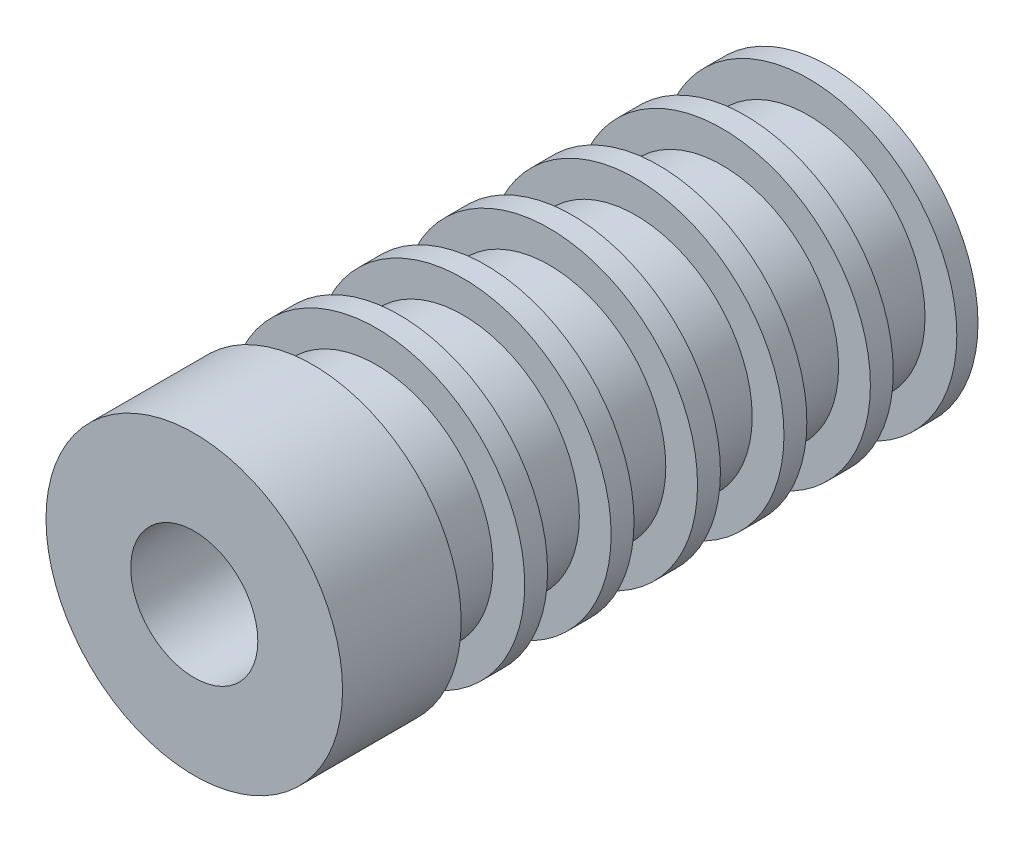
ISO-10303-21;
HEADER;
FILE_DESCRIPTION(('STEP AP214'),'2;1');
FILE_NAME('part.step','',(''),(''),'','','');
FILE_SCHEMA(('AUTOMOTIVE_DESIGN { 1 0 10303 214 1 1 1 1 }'));
ENDSEC;
DATA;
#1=APPLICATION_CONTEXT('core data for automotive mechanical design processes');
#2=APPLICATION_PROTOCOL_DEFINITION('international standard','automotive_design',2000,#1);
#3=PRODUCT_CONTEXT('',#1,'mechanical');
#4=PRODUCT('Part','Part','',(#3));
#5=PRODUCT_RELATED_PRODUCT_CATEGORY('part','',(#4));
#6=PRODUCT_DEFINITION_FORMATION('','',#4);
#7=PRODUCT_DEFINITION_CONTEXT('part definition',#1,'design');
#8=PRODUCT_DEFINITION('design','',#6,#7);
#9=PRODUCT_DEFINITION_SHAPE('','',#8);
#10=(LENGTH_UNIT() NAMED_UNIT(*) SI_UNIT(.MILLI.,.METRE.));
#11=(NAMED_UNIT(*) PLANE_ANGLE_UNIT() SI_UNIT($,.RADIAN.));
#12=(NAMED_UNIT(*) SI_UNIT($,.STERADIAN.) SOLID_ANGLE_UNIT());
#13=UNCERTAINTY_MEASURE_WITH_UNIT(LENGTH_MEASURE(1.E-05),#10,'distance_accuracy_value','');
#14=(GEOMETRIC_REPRESENTATION_CONTEXT(3) GLOBAL_UNCERTAINTY_ASSIGNED_CONTEXT((#13)) GLOBAL_UNIT_ASSIGNED_CONTEXT((#10,
#11,#12)) REPRESENTATION_CONTEXT('',''));
#15=CARTESIAN_POINT('',(0.,0.,0.));
#16=DIRECTION('',(0.,0.,1.));
#17=DIRECTION('',(1.,0.,0.));
#18=AXIS2_PLACEMENT_3D('',#15,#16,#17);
#19=CARTESIAN_POINT('',(0.,0.,25.4));
#20=DIRECTION('',(0.,0.,-1.));
#21=DIRECTION('',(-1.,0.,0.));
#22=AXIS2_PLACEMENT_3D('',#19,#20,#21);
#23=CYLINDRICAL_SURFACE('',#22,11.1125);
#24=CARTESIAN_POINT('',(0.,0.,22.225));
#25=DIRECTION('',(0.,0.,1.));
#26=DIRECTION('',(1.,0.,0.));
#27=AXIS2_PLACEMENT_3D('',#24,#25,#26);
#28=CIRCLE('',#27,11.1125);
#29=CARTESIAN_POINT('',(11.1125,0.,22.225));
#30=VERTEX_POINT('',#29);
#31=EDGE_CURVE('E39',#30,#30,#28,.T.);
#32=ORIENTED_EDGE('',*,*,#31,.F.);
#33=EDGE_LOOP('',(#32));
#34=FACE_BOUND('',#33,.T.);
#35=CARTESIAN_POINT('',(0.,0.,13.335));
#36=DIRECTION('',(0.,0.,-1.));
#37=DIRECTION('',(-1.,0.,0.));
#38=AXIS2_PLACEMENT_3D('',#35,#36,#37);
#39=CIRCLE('',#38,11.1125);
#40=CARTESIAN_POINT('',(-11.1125,0.,13.335));
#41=VERTEX_POINT('',#40);
#42=EDGE_CURVE('E68',#41,#41,#39,.T.);
#43=ORIENTED_EDGE('',*,*,#42,.F.);
#44=EDGE_LOOP('',(#43));
#45=FACE_BOUND('',#44,.T.);
#46=ADVANCED_FACE('F32',(#34,#45),#23,.T.);
#47=CARTESIAN_POINT('',(0.,0.,-17.3355));
#48=DIRECTION('',(0.,0.,-1.));
#49=DIRECTION('',(-1.,0.,0.));
#50=AXIS2_PLACEMENT_3D('',#47,#48,#49);
#51=CIRCLE('',#50,11.1125);
#52=CARTESIAN_POINT('',(-11.1125,0.,-17.3355));
#53=VERTEX_POINT('',#52);
#54=EDGE_CURVE('E114',#53,#53,#51,.T.);
#55=ORIENTED_EDGE('',*,*,#54,.T.);
#56=EDGE_LOOP('',(#55));
#57=FACE_BOUND('',#56,.T.);
#58=CARTESIAN_POINT('',(0.,0.,-19.05));
#59=DIRECTION('',(0.,0.,-1.));
#60=DIRECTION('',(-1.,0.,0.));
#61=AXIS2_PLACEMENT_3D('',#58,#59,#60);
#62=CIRCLE('',#61,11.1125);
#63=CARTESIAN_POINT('',(-11.1125,0.,-19.05));
#64=VERTEX_POINT('',#63);
#65=EDGE_CURVE('E51',#64,#64,#62,.T.);
#66=ORIENTED_EDGE('',*,*,#65,.F.);
#67=EDGE_LOOP('',(#66));
#68=FACE_BOUND('',#67,.T.);
#69=ADVANCED_FACE('F158',(#57,#68),#23,.T.);
#70=CARTESIAN_POINT('',(0.,0.,-23.8125));
#71=DIRECTION('',(0.,0.,-1.));
#72=DIRECTION('',(-1.,0.,0.));
#73=AXIS2_PLACEMENT_3D('',#70,#71,#72);
#74=CIRCLE('',#73,11.1125);
#75=CARTESIAN_POINT('',(-11.1125,0.,-23.8125));
#76=VERTEX_POINT('',#75);
#77=EDGE_CURVE('E53',#76,#76,#74,.T.);
#78=ORIENTED_EDGE('',*,*,#77,.T.);
#79=EDGE_LOOP('',(#78));
#80=FACE_BOUND('',#79,.T.);
#81=CARTESIAN_POINT('',(0.,0.,-25.4));
#82=DIRECTION('',(0.,0.,1.));
#83=DIRECTION('',(1.,0.,0.));
#84=AXIS2_PLACEMENT_3D('',#81,#82,#83);
#85=CIRCLE('',#84,11.1125);
#86=CARTESIAN_POINT('',(11.1125,0.,-25.4));
#87=VERTEX_POINT('',#86);
#88=EDGE_CURVE('E10',#87,#87,#85,.T.);
#89=ORIENTED_EDGE('',*,*,#88,.T.);
#90=EDGE_LOOP('',(#89));
#91=FACE_BOUND('',#90,.T.);
#92=ADVANCED_FACE('F34',(#80,#91),#23,.T.);
#93=CARTESIAN_POINT('',(0.,0.,-25.4));
#94=DIRECTION('',(0.,0.,1.));
#95=DIRECTION('',(1.,0.,0.));
#96=AXIS2_PLACEMENT_3D('',#93,#94,#95);
#97=PLANE('',#96);
#98=CARTESIAN_POINT('',(0.,0.,-25.4));
#99=DIRECTION('',(0.,0.,1.));
#100=DIRECTION('',(1.,0.,0.));
#101=AXIS2_PLACEMENT_3D('',#98,#99,#100);
#102=CIRCLE('',#101,4.7625);
#103=CARTESIAN_POINT('',(4.7625,0.,-25.4));
#104=VERTEX_POINT('',#103);
#105=EDGE_CURVE('E43',#104,#104,#102,.T.);
#106=ORIENTED_EDGE('',*,*,#105,.T.);
#107=EDGE_LOOP('',(#106));
#108=FACE_BOUND('',#107,.T.);
#109=ORIENTED_EDGE('',*,*,#88,.F.);
#110=EDGE_LOOP('',(#109));
#111=FACE_BOUND('',#110,.T.);
#112=ADVANCED_FACE('F157',(#108,#111),#97,.F.);
#113=CARTESIAN_POINT('',(0.,0.,22.225));
#114=DIRECTION('',(0.,0.,1.));
#115=DIRECTION('',(1.,0.,0.));
#116=AXIS2_PLACEMENT_3D('',#113,#114,#115);
#117=PLANE('',#116);
#118=CARTESIAN_POINT('',(0.,0.,22.225));
#119=DIRECTION('',(0.,0.,1.));
#120=DIRECTION('',(1.,0.,0.));
#121=AXIS2_PLACEMENT_3D('',#118,#119,#120);
#122=CIRCLE('',#121,4.7625);
#123=CARTESIAN_POINT('',(4.7625,0.,22.225));
#124=VERTEX_POINT('',#123);
#125=EDGE_CURVE('E47',#124,#124,#122,.T.);
#126=ORIENTED_EDGE('',*,*,#125,.F.);
#127=EDGE_LOOP('',(#126));
#128=FACE_BOUND('',#127,.T.);
#129=ORIENTED_EDGE('',*,*,#31,.T.);
#130=EDGE_LOOP('',(#129));
#131=FACE_BOUND('',#130,.T.);
#132=ADVANCED_FACE('F234',(#128,#131),#117,.T.);
#133=CARTESIAN_POINT('',(0.,0.,-25.4));
#134=DIRECTION('',(0.,0.,1.));
#135=DIRECTION('',(1.,0.,0.));
#136=AXIS2_PLACEMENT_3D('',#133,#134,#135);
#137=CYLINDRICAL_SURFACE('',#136,4.7625);
#138=ORIENTED_EDGE('',*,*,#105,.F.);
#139=EDGE_LOOP('',(#138));
#140=FACE_BOUND('',#139,.T.);
#141=ORIENTED_EDGE('',*,*,#125,.T.);
#142=EDGE_LOOP('',(#141));
#143=FACE_BOUND('',#142,.T.);
#144=ADVANCED_FACE('F227',(#140,#143),#137,.F.);
#145=CARTESIAN_POINT('',(0.,0.,-19.05));
#146=DIRECTION('',(0.,0.,-1.));
#147=DIRECTION('',(-1.,0.,0.));
#148=AXIS2_PLACEMENT_3D('',#145,#146,#147);
#149=PLANE('',#148);
#150=CARTESIAN_POINT('',(0.,0.,-19.05));
#151=DIRECTION('',(0.,0.,-1.));
#152=DIRECTION('',(-1.,0.,0.));
#153=AXIS2_PLACEMENT_3D('',#150,#151,#152);
#154=CIRCLE('',#153,8.73125);
#155=CARTESIAN_POINT('',(-8.73125,0.,-19.05));
#156=VERTEX_POINT('',#155);
#157=EDGE_CURVE('E56',#156,#156,#154,.T.);
#158=ORIENTED_EDGE('',*,*,#157,.F.);
#159=EDGE_LOOP('',(#158));
#160=FACE_BOUND('',#159,.T.);
#161=ORIENTED_EDGE('',*,*,#65,.T.);
#162=EDGE_LOOP('',(#161));
#163=FACE_BOUND('',#162,.T.);
#164=ADVANCED_FACE('F224',(#160,#163),#149,.T.);
#165=CARTESIAN_POINT('',(0.,0.,-23.8125));
#166=DIRECTION('',(0.,0.,-1.));
#167=DIRECTION('',(-1.,0.,0.));
#168=AXIS2_PLACEMENT_3D('',#165,#166,#167);
#169=PLANE('',#168);
#170=CARTESIAN_POINT('',(0.,0.,-23.8125));
#171=DIRECTION('',(0.,0.,-1.));
#172=DIRECTION('',(-1.,0.,0.));
#173=AXIS2_PLACEMENT_3D('',#170,#171,#172);
#174=CIRCLE('',#173,8.73125);
#175=CARTESIAN_POINT('',(-8.73125,0.,-23.8125));
#176=VERTEX_POINT('',#175);
#177=EDGE_CURVE('E59',#176,#176,#174,.T.);
#178=ORIENTED_EDGE('',*,*,#177,.T.);
#179=EDGE_LOOP('',(#178));
#180=FACE_BOUND('',#179,.T.);
#181=ORIENTED_EDGE('',*,*,#77,.F.);
#182=EDGE_LOOP('',(#181));
#183=FACE_BOUND('',#182,.T.);
#184=ADVANCED_FACE('F222',(#180,#183),#169,.F.);
#185=CARTESIAN_POINT('',(0.,0.,-19.05));
#186=DIRECTION('',(0.,0.,-1.));
#187=DIRECTION('',(-1.,0.,0.));
#188=AXIS2_PLACEMENT_3D('',#185,#186,#187);
#189=CYLINDRICAL_SURFACE('',#188,8.73125);
#190=ORIENTED_EDGE('',*,*,#157,.T.);
#191=EDGE_LOOP('',(#190));
#192=FACE_BOUND('',#191,.T.);
#193=ORIENTED_EDGE('',*,*,#177,.F.);
#194=EDGE_LOOP('',(#193));
#195=FACE_BOUND('',#194,.T.);
#196=ADVANCED_FACE('F215',(#192,#195),#189,.T.);
#197=CARTESIAN_POINT('',(0.,0.,13.335));
#198=DIRECTION('',(0.,0.,-1.));
#199=DIRECTION('',(-1.,0.,0.));
#200=AXIS2_PLACEMENT_3D('',#197,#198,#199);
#201=PLANE('',#200);
#202=CARTESIAN_POINT('',(0.,0.,13.335));
#203=DIRECTION('',(0.,0.,-1.));
#204=DIRECTION('',(-1.,0.,0.));
#205=AXIS2_PLACEMENT_3D('',#202,#203,#204);
#206=CIRCLE('',#205,8.73125);
#207=CARTESIAN_POINT('',(-8.73125,0.,13.335));
#208=VERTEX_POINT('',#207);
#209=EDGE_CURVE('E69',#208,#208,#206,.T.);
#210=ORIENTED_EDGE('',*,*,#209,.F.);
#211=EDGE_LOOP('',(#210));
#212=FACE_BOUND('',#211,.T.);
#213=ORIENTED_EDGE('',*,*,#42,.T.);
#214=EDGE_LOOP('',(#213));
#215=FACE_BOUND('',#214,.T.);
#216=ADVANCED_FACE('F212',(#212,#215),#201,.T.);
#217=CARTESIAN_POINT('',(0.,0.,8.5725));
#218=DIRECTION('',(0.,0.,-1.));
#219=DIRECTION('',(-1.,0.,0.));
#220=AXIS2_PLACEMENT_3D('',#217,#218,#219);
#221=PLANE('',#220);
#222=CARTESIAN_POINT('',(0.,0.,8.5725));
#223=DIRECTION('',(0.,0.,-1.));
#224=DIRECTION('',(-1.,0.,0.));
#225=AXIS2_PLACEMENT_3D('',#222,#223,#224);
#226=CIRCLE('',#225,8.73125);
#227=CARTESIAN_POINT('',(-8.73125,0.,8.5725));
#228=VERTEX_POINT('',#227);
#229=EDGE_CURVE('E73',#228,#228,#226,.T.);
#230=ORIENTED_EDGE('',*,*,#229,.T.);
#231=EDGE_LOOP('',(#230));
#232=FACE_BOUND('',#231,.T.);
#233=CARTESIAN_POINT('',(0.,0.,8.5725));
#234=DIRECTION('',(0.,0.,-1.));
#235=DIRECTION('',(-1.,0.,0.));
#236=AXIS2_PLACEMENT_3D('',#233,#234,#235);
#237=CIRCLE('',#236,11.1125);
#238=CARTESIAN_POINT('',(-11.1125,0.,8.5725));
#239=VERTEX_POINT('',#238);
#240=EDGE_CURVE('E65',#239,#239,#237,.T.);
#241=ORIENTED_EDGE('',*,*,#240,.F.);
#242=EDGE_LOOP('',(#241));
#243=FACE_BOUND('',#242,.T.);
#244=ADVANCED_FACE('F210',(#232,#243),#221,.F.);
#245=CARTESIAN_POINT('',(0.,0.,13.335));
#246=DIRECTION('',(0.,0.,-1.));
#247=DIRECTION('',(-1.,0.,0.));
#248=AXIS2_PLACEMENT_3D('',#245,#246,#247);
#249=CYLINDRICAL_SURFACE('',#248,8.73125);
#250=ORIENTED_EDGE('',*,*,#209,.T.);
#251=EDGE_LOOP('',(#250));
#252=FACE_BOUND('',#251,.T.);
#253=ORIENTED_EDGE('',*,*,#229,.F.);
#254=EDGE_LOOP('',(#253));
#255=FACE_BOUND('',#254,.T.);
#256=ADVANCED_FACE('F132',(#252,#255),#249,.T.);
#257=CARTESIAN_POINT('',(0.,0.,-12.573));
#258=DIRECTION('',(0.,0.,-1.));
#259=DIRECTION('',(-1.,0.,0.));
#260=AXIS2_PLACEMENT_3D('',#257,#258,#259);
#261=PLANE('',#260);
#262=CARTESIAN_POINT('',(0.,0.,-12.573));
#263=DIRECTION('',(0.,0.,-1.));
#264=DIRECTION('',(-1.,0.,0.));
#265=AXIS2_PLACEMENT_3D('',#262,#263,#264);
#266=CIRCLE('',#265,8.73125);
#267=CARTESIAN_POINT('',(-8.73125,0.,-12.573));
#268=VERTEX_POINT('',#267);
#269=EDGE_CURVE('E117',#268,#268,#266,.T.);
#270=ORIENTED_EDGE('',*,*,#269,.F.);
#271=EDGE_LOOP('',(#270));
#272=FACE_BOUND('',#271,.T.);
#273=CARTESIAN_POINT('',(0.,0.,-12.573));
#274=DIRECTION('',(0.,0.,-1.));
#275=DIRECTION('',(-1.,0.,0.));
#276=AXIS2_PLACEMENT_3D('',#273,#274,#275);
#277=CIRCLE('',#276,11.1125);
#278=CARTESIAN_POINT('',(-11.1125,0.,-12.573));
#279=VERTEX_POINT('',#278);
#280=EDGE_CURVE('E62',#279,#279,#277,.T.);
#281=ORIENTED_EDGE('',*,*,#280,.T.);
#282=EDGE_LOOP('',(#281));
#283=FACE_BOUND('',#282,.T.);
#284=ADVANCED_FACE('F128',(#272,#283),#261,.T.);
#285=CARTESIAN_POINT('',(0.,0.,-17.3355));
#286=DIRECTION('',(0.,0.,-1.));
#287=DIRECTION('',(-1.,0.,0.));
#288=AXIS2_PLACEMENT_3D('',#285,#286,#287);
#289=PLANE('',#288);
#290=CARTESIAN_POINT('',(0.,0.,-17.3355));
#291=DIRECTION('',(0.,0.,-1.));
#292=DIRECTION('',(-1.,0.,0.));
#293=AXIS2_PLACEMENT_3D('',#290,#291,#292);
#294=CIRCLE('',#293,8.73125);
#295=CARTESIAN_POINT('',(-8.73125,0.,-17.3355));
#296=VERTEX_POINT('',#295);
#297=EDGE_CURVE('E109',#296,#296,#294,.T.);
#298=ORIENTED_EDGE('',*,*,#297,.T.);
#299=EDGE_LOOP('',(#298));
#300=FACE_BOUND('',#299,.T.);
#301=ORIENTED_EDGE('',*,*,#54,.F.);
#302=EDGE_LOOP('',(#301));
#303=FACE_BOUND('',#302,.T.);
#304=ADVANCED_FACE('F131',(#300,#303),#289,.F.);
#305=CARTESIAN_POINT('',(0.,0.,-12.573));
#306=DIRECTION('',(0.,0.,-1.));
#307=DIRECTION('',(-1.,0.,0.));
#308=AXIS2_PLACEMENT_3D('',#305,#306,#307);
#309=CYLINDRICAL_SURFACE('',#308,8.73125);
#310=ORIENTED_EDGE('',*,*,#269,.T.);
#311=EDGE_LOOP('',(#310));
#312=FACE_BOUND('',#311,.T.);
#313=ORIENTED_EDGE('',*,*,#297,.F.);
#314=EDGE_LOOP('',(#313));
#315=FACE_BOUND('',#314,.T.);
#316=ADVANCED_FACE('F125',(#312,#315),#309,.T.);
#317=ORIENTED_EDGE('',*,*,#240,.T.);
#318=EDGE_LOOP('',(#317));
#319=FACE_BOUND('',#318,.T.);
#320=CARTESIAN_POINT('',(0.,0.,6.858));
#321=DIRECTION('',(0.,0.,-1.));
#322=DIRECTION('',(-1.,0.,0.));
#323=AXIS2_PLACEMENT_3D('',#320,#321,#322);
#324=CIRCLE('',#323,11.1125);
#325=CARTESIAN_POINT('',(-11.1125,0.,6.858));
#326=VERTEX_POINT('',#325);
#327=EDGE_CURVE('E81',#326,#326,#324,.T.);
#328=ORIENTED_EDGE('',*,*,#327,.F.);
#329=EDGE_LOOP('',(#328));
#330=FACE_BOUND('',#329,.T.);
#331=ADVANCED_FACE('F162',(#319,#330),#23,.T.);
#332=CARTESIAN_POINT('',(0.,0.,6.858));
#333=DIRECTION('',(0.,0.,-1.));
#334=DIRECTION('',(-1.,0.,0.));
#335=AXIS2_PLACEMENT_3D('',#332,#333,#334);
#336=PLANE('',#335);
#337=CARTESIAN_POINT('',(0.,0.,6.858));
#338=DIRECTION('',(0.,0.,-1.));
#339=DIRECTION('',(-1.,0.,0.));
#340=AXIS2_PLACEMENT_3D('',#337,#338,#339);
#341=CIRCLE('',#340,8.73125);
#342=CARTESIAN_POINT('',(-8.73125,0.,6.858));
#343=VERTEX_POINT('',#342);
#344=EDGE_CURVE('E82',#343,#343,#341,.T.);
#345=ORIENTED_EDGE('',*,*,#344,.F.);
#346=EDGE_LOOP('',(#345));
#347=FACE_BOUND('',#346,.T.);
#348=ORIENTED_EDGE('',*,*,#327,.T.);
#349=EDGE_LOOP('',(#348));
#350=FACE_BOUND('',#349,.T.);
#351=ADVANCED_FACE('F169',(#347,#350),#336,.T.);
#352=CARTESIAN_POINT('',(0.,0.,2.0955));
#353=DIRECTION('',(0.,0.,-1.));
#354=DIRECTION('',(-1.,0.,0.));
#355=AXIS2_PLACEMENT_3D('',#352,#353,#354);
#356=PLANE('',#355);
#357=CARTESIAN_POINT('',(0.,0.,2.0955));
#358=DIRECTION('',(0.,0.,-1.));
#359=DIRECTION('',(-1.,0.,0.));
#360=AXIS2_PLACEMENT_3D('',#357,#358,#359);
#361=CIRCLE('',#360,8.73125);
#362=CARTESIAN_POINT('',(-8.73125,0.,2.0955));
#363=VERTEX_POINT('',#362);
#364=EDGE_CURVE('E72',#363,#363,#361,.T.);
#365=ORIENTED_EDGE('',*,*,#364,.T.);
#366=EDGE_LOOP('',(#365));
#367=FACE_BOUND('',#366,.T.);
#368=CARTESIAN_POINT('',(0.,0.,2.0955));
#369=DIRECTION('',(0.,0.,-1.));
#370=DIRECTION('',(-1.,0.,0.));
#371=AXIS2_PLACEMENT_3D('',#368,#369,#370);
#372=CIRCLE('',#371,11.1125);
#373=CARTESIAN_POINT('',(-11.1125,0.,2.0955));
#374=VERTEX_POINT('',#373);
#375=EDGE_CURVE('E78',#374,#374,#372,.T.);
#376=ORIENTED_EDGE('',*,*,#375,.F.);
#377=EDGE_LOOP('',(#376));
#378=FACE_BOUND('',#377,.T.);
#379=ADVANCED_FACE('F149',(#367,#378),#356,.F.);
#380=CARTESIAN_POINT('',(0.,0.,6.858));
#381=DIRECTION('',(0.,0.,-1.));
#382=DIRECTION('',(-1.,0.,0.));
#383=AXIS2_PLACEMENT_3D('',#380,#381,#382);
#384=CYLINDRICAL_SURFACE('',#383,8.73125);
#385=ORIENTED_EDGE('',*,*,#344,.T.);
#386=EDGE_LOOP('',(#385));
#387=FACE_BOUND('',#386,.T.);
#388=ORIENTED_EDGE('',*,*,#364,.F.);
#389=EDGE_LOOP('',(#388));
#390=FACE_BOUND('',#389,.T.);
#391=ADVANCED_FACE('F139',(#387,#390),#384,.T.);
#392=CARTESIAN_POINT('',(0.,0.,-10.8585));
#393=DIRECTION('',(0.,0.,-1.));
#394=DIRECTION('',(-1.,0.,0.));
#395=AXIS2_PLACEMENT_3D('',#392,#393,#394);
#396=CIRCLE('',#395,11.1125);
#397=CARTESIAN_POINT('',(-11.1125,0.,-10.8585));
#398=VERTEX_POINT('',#397);
#399=EDGE_CURVE('E102',#398,#398,#396,.T.);
#400=ORIENTED_EDGE('',*,*,#399,.T.);
#401=EDGE_LOOP('',(#400));
#402=FACE_BOUND('',#401,.T.);
#403=ORIENTED_EDGE('',*,*,#280,.F.);
#404=EDGE_LOOP('',(#403));
#405=FACE_BOUND('',#404,.T.);
#406=ADVANCED_FACE('F136',(#402,#405),#23,.T.);
#407=CARTESIAN_POINT('',(0.,0.,-6.096));
#408=DIRECTION('',(0.,0.,-1.));
#409=DIRECTION('',(-1.,0.,0.));
#410=AXIS2_PLACEMENT_3D('',#407,#408,#409);
#411=PLANE('',#410);
#412=CARTESIAN_POINT('',(0.,0.,-6.096));
#413=DIRECTION('',(0.,0.,-1.));
#414=DIRECTION('',(-1.,0.,0.));
#415=AXIS2_PLACEMENT_3D('',#412,#413,#414);
#416=CIRCLE('',#415,8.73125);
#417=CARTESIAN_POINT('',(-8.73125,0.,-6.096));
#418=VERTEX_POINT('',#417);
#419=EDGE_CURVE('E106',#418,#418,#416,.T.);
#420=ORIENTED_EDGE('',*,*,#419,.F.);
#421=EDGE_LOOP('',(#420));
#422=FACE_BOUND('',#421,.T.);
#423=CARTESIAN_POINT('',(0.,0.,-6.096));
#424=DIRECTION('',(0.,0.,-1.));
#425=DIRECTION('',(-1.,0.,0.));
#426=AXIS2_PLACEMENT_3D('',#423,#424,#425);
#427=CIRCLE('',#426,11.1125);
#428=CARTESIAN_POINT('',(-11.1125,0.,-6.096));
#429=VERTEX_POINT('',#428);
#430=EDGE_CURVE('E105',#429,#429,#427,.T.);
#431=ORIENTED_EDGE('',*,*,#430,.T.);
#432=EDGE_LOOP('',(#431));
#433=FACE_BOUND('',#432,.T.);
#434=ADVANCED_FACE('F138',(#422,#433),#411,.T.);
#435=CARTESIAN_POINT('',(0.,0.,-10.8585));
#436=DIRECTION('',(0.,0.,-1.));
#437=DIRECTION('',(-1.,0.,0.));
#438=AXIS2_PLACEMENT_3D('',#435,#436,#437);
#439=PLANE('',#438);
#440=CARTESIAN_POINT('',(0.,0.,-10.8585));
#441=DIRECTION('',(0.,0.,-1.));
#442=DIRECTION('',(-1.,0.,0.));
#443=AXIS2_PLACEMENT_3D('',#440,#441,#442);
#444=CIRCLE('',#443,8.73125);
#445=CARTESIAN_POINT('',(-8.73125,0.,-10.8585));
#446=VERTEX_POINT('',#445);
#447=EDGE_CURVE('E97',#446,#446,#444,.T.);
#448=ORIENTED_EDGE('',*,*,#447,.T.);
#449=EDGE_LOOP('',(#448));
#450=FACE_BOUND('',#449,.T.);
#451=ORIENTED_EDGE('',*,*,#399,.F.);
#452=EDGE_LOOP('',(#451));
#453=FACE_BOUND('',#452,.T.);
#454=ADVANCED_FACE('F146',(#450,#453),#439,.F.);
#455=CARTESIAN_POINT('',(0.,0.,-6.096));
#456=DIRECTION('',(0.,0.,-1.));
#457=DIRECTION('',(-1.,0.,0.));
#458=AXIS2_PLACEMENT_3D('',#455,#456,#457);
#459=CYLINDRICAL_SURFACE('',#458,8.73125);
#460=ORIENTED_EDGE('',*,*,#419,.T.);
#461=EDGE_LOOP('',(#460));
#462=FACE_BOUND('',#461,.T.);
#463=ORIENTED_EDGE('',*,*,#447,.F.);
#464=EDGE_LOOP('',(#463));
#465=FACE_BOUND('',#464,.T.);
#466=ADVANCED_FACE('F180',(#462,#465),#459,.T.);
#467=ORIENTED_EDGE('',*,*,#375,.T.);
#468=EDGE_LOOP('',(#467));
#469=FACE_BOUND('',#468,.T.);
#470=CARTESIAN_POINT('',(0.,0.,0.381000000000002));
#471=DIRECTION('',(0.,0.,-1.));
#472=DIRECTION('',(-1.,0.,0.));
#473=AXIS2_PLACEMENT_3D('',#470,#471,#472);
#474=CIRCLE('',#473,11.1125);
#475=CARTESIAN_POINT('',(-11.1125,0.,0.381000000000002));
#476=VERTEX_POINT('',#475);
#477=EDGE_CURVE('E93',#476,#476,#474,.T.);
#478=ORIENTED_EDGE('',*,*,#477,.F.);
#479=EDGE_LOOP('',(#478));
#480=FACE_BOUND('',#479,.T.);
#481=ADVANCED_FACE('F154',(#469,#480),#23,.T.);
#482=CARTESIAN_POINT('',(0.,0.,-4.3815));
#483=DIRECTION('',(0.,0.,-1.));
#484=DIRECTION('',(-1.,0.,0.));
#485=AXIS2_PLACEMENT_3D('',#482,#483,#484);
#486=CIRCLE('',#485,11.1125);
#487=CARTESIAN_POINT('',(-11.1125,0.,-4.3815));
#488=VERTEX_POINT('',#487);
#489=EDGE_CURVE('E90',#488,#488,#486,.T.);
#490=ORIENTED_EDGE('',*,*,#489,.T.);
#491=EDGE_LOOP('',(#490));
#492=FACE_BOUND('',#491,.T.);
#493=ORIENTED_EDGE('',*,*,#430,.F.);
#494=EDGE_LOOP('',(#493));
#495=FACE_BOUND('',#494,.T.);
#496=ADVANCED_FACE('F141',(#492,#495),#23,.T.);
#497=CARTESIAN_POINT('',(0.,0.,0.381000000000002));
#498=DIRECTION('',(0.,0.,-1.));
#499=DIRECTION('',(-1.,0.,0.));
#500=AXIS2_PLACEMENT_3D('',#497,#498,#499);
#501=PLANE('',#500);
#502=CARTESIAN_POINT('',(0.,0.,0.381000000000002));
#503=DIRECTION('',(0.,0.,-1.));
#504=DIRECTION('',(-1.,0.,0.));
#505=AXIS2_PLACEMENT_3D('',#502,#503,#504);
#506=CIRCLE('',#505,8.73125);
#507=CARTESIAN_POINT('',(-8.73125,0.,0.381000000000002));
#508=VERTEX_POINT('',#507);
#509=EDGE_CURVE('E94',#508,#508,#506,.T.);
#510=ORIENTED_EDGE('',*,*,#509,.F.);
#511=EDGE_LOOP('',(#510));
#512=FACE_BOUND('',#511,.T.);
#513=ORIENTED_EDGE('',*,*,#477,.T.);
#514=EDGE_LOOP('',(#513));
#515=FACE_BOUND('',#514,.T.);
#516=ADVANCED_FACE('F153',(#512,#515),#501,.T.);
#517=CARTESIAN_POINT('',(0.,0.,-4.3815));
#518=DIRECTION('',(0.,0.,-1.));
#519=DIRECTION('',(-1.,0.,0.));
#520=AXIS2_PLACEMENT_3D('',#517,#518,#519);
#521=PLANE('',#520);
#522=CARTESIAN_POINT('',(0.,0.,-4.3815));
#523=DIRECTION('',(0.,0.,-1.));
#524=DIRECTION('',(-1.,0.,0.));
#525=AXIS2_PLACEMENT_3D('',#522,#523,#524);
#526=CIRCLE('',#525,8.73125);
#527=CARTESIAN_POINT('',(-8.73125,0.,-4.3815));
#528=VERTEX_POINT('',#527);
#529=EDGE_CURVE('E85',#528,#528,#526,.T.);
#530=ORIENTED_EDGE('',*,*,#529,.T.);
#531=EDGE_LOOP('',(#530));
#532=FACE_BOUND('',#531,.T.);
#533=ORIENTED_EDGE('',*,*,#489,.F.);
#534=EDGE_LOOP('',(#533));
#535=FACE_BOUND('',#534,.T.);
#536=ADVANCED_FACE('F192',(#532,#535),#521,.F.);
#537=CARTESIAN_POINT('',(0.,0.,0.381000000000002));
#538=DIRECTION('',(0.,0.,-1.));
#539=DIRECTION('',(-1.,0.,0.));
#540=AXIS2_PLACEMENT_3D('',#537,#538,#539);
#541=CYLINDRICAL_SURFACE('',#540,8.73125);
#542=ORIENTED_EDGE('',*,*,#509,.T.);
#543=EDGE_LOOP('',(#542));
#544=FACE_BOUND('',#543,.T.);
#545=ORIENTED_EDGE('',*,*,#529,.F.);
#546=EDGE_LOOP('',(#545));
#547=FACE_BOUND('',#546,.T.);
#548=ADVANCED_FACE('F198',(#544,#547),#541,.T.);
#549=CLOSED_SHELL('',(#46,#69,#92,#112,#132,#144,#164,#184,#196,#216,#244,#256,#284,#304,#316,
#331,#351,#379,#391,#406,#434,#454,#466,#481,#496,#516,#536,#548));
#550=MANIFOLD_SOLID_BREP('B2',#549);
#551=ADVANCED_BREP_SHAPE_REPRESENTATION('',(#18,#550),#14);
#552=SHAPE_DEFINITION_REPRESENTATION(#9,#551);
ENDSEC;
END-ISO-10303-21;
